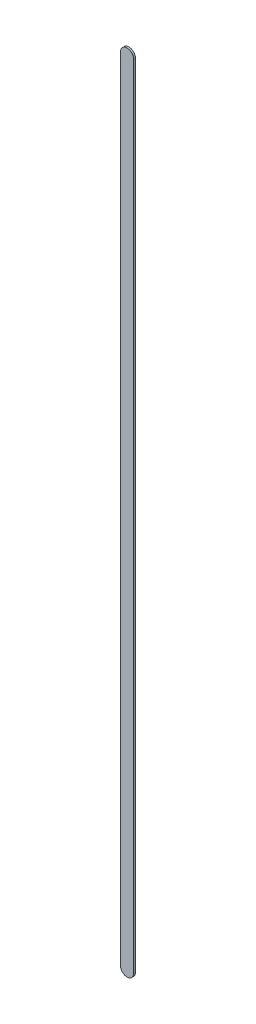
ISO-10303-21;
HEADER;
FILE_DESCRIPTION(('STEP AP214'),'2;1');
FILE_NAME('part.step','',(''),(''),'','','');
FILE_SCHEMA(('AUTOMOTIVE_DESIGN { 1 0 10303 214 1 1 1 1 }'));
ENDSEC;
DATA;
#1=APPLICATION_CONTEXT('core data for automotive mechanical design processes');
#2=APPLICATION_PROTOCOL_DEFINITION('international standard','automotive_design',2000,#1);
#3=PRODUCT_CONTEXT('',#1,'mechanical');
#4=PRODUCT('Part','Part','',(#3));
#5=PRODUCT_RELATED_PRODUCT_CATEGORY('part','',(#4));
#6=PRODUCT_DEFINITION_FORMATION('','',#4);
#7=PRODUCT_DEFINITION_CONTEXT('part definition',#1,'design');
#8=PRODUCT_DEFINITION('design','',#6,#7);
#9=PRODUCT_DEFINITION_SHAPE('','',#8);
#10=(LENGTH_UNIT() NAMED_UNIT(*) SI_UNIT(.MILLI.,.METRE.));
#11=(NAMED_UNIT(*) PLANE_ANGLE_UNIT() SI_UNIT($,.RADIAN.));
#12=(NAMED_UNIT(*) SI_UNIT($,.STERADIAN.) SOLID_ANGLE_UNIT());
#13=UNCERTAINTY_MEASURE_WITH_UNIT(LENGTH_MEASURE(1.E-05),#10,'distance_accuracy_value','');
#14=(GEOMETRIC_REPRESENTATION_CONTEXT(3) GLOBAL_UNCERTAINTY_ASSIGNED_CONTEXT((#13)) GLOBAL_UNIT_ASSIGNED_CONTEXT((#10,
#11,#12)) REPRESENTATION_CONTEXT('',''));
#15=CARTESIAN_POINT('',(0.,0.,0.));
#16=DIRECTION('',(0.,0.,1.));
#17=DIRECTION('',(1.,0.,0.));
#18=AXIS2_PLACEMENT_3D('',#15,#16,#17);
#19=CARTESIAN_POINT('',(78.64397276,81.9869709,0.));
#20=DIRECTION('',(-1.,0.,0.));
#21=DIRECTION('',(0.,1.,0.));
#22=AXIS2_PLACEMENT_3D('',#19,#20,#21);
#23=PLANE('',#22);
#24=DIRECTION('',(0.,1.,0.));
#25=VECTOR('',#24,1.);
#26=CARTESIAN_POINT('',(78.64397276,81.9869709,0.03556));
#27=LINE('',#26,#25);
#28=CARTESIAN_POINT('',(78.64397276,81.9869709,0.03556));
#29=VERTEX_POINT('',#28);
#30=CARTESIAN_POINT('',(78.64397276,97.28697332,0.03556));
#31=VERTEX_POINT('',#30);
#32=EDGE_CURVE('E11',#29,#31,#27,.T.);
#33=ORIENTED_EDGE('',*,*,#32,.F.);
#34=DIRECTION('',(0.,0.,1.));
#35=VECTOR('',#34,1.);
#36=CARTESIAN_POINT('',(78.64397276,81.9869709,0.));
#37=LINE('',#36,#35);
#38=CARTESIAN_POINT('',(78.64397276,81.9869709,0.));
#39=VERTEX_POINT('',#38);
#40=EDGE_CURVE('E24',#39,#29,#37,.T.);
#41=ORIENTED_EDGE('',*,*,#40,.F.);
#42=DIRECTION('',(0.,1.,0.));
#43=VECTOR('',#42,1.);
#44=CARTESIAN_POINT('',(78.64397276,81.9869709,0.));
#45=LINE('',#44,#43);
#46=CARTESIAN_POINT('',(78.64397276,97.28697332,0.));
#47=VERTEX_POINT('',#46);
#48=EDGE_CURVE('E75',#39,#47,#45,.T.);
#49=ORIENTED_EDGE('',*,*,#48,.T.);
#50=DIRECTION('',(0.,0.,1.));
#51=VECTOR('',#50,1.);
#52=CARTESIAN_POINT('',(78.64397276,97.28697332,0.));
#53=LINE('',#52,#51);
#54=EDGE_CURVE('E37',#47,#31,#53,.T.);
#55=ORIENTED_EDGE('',*,*,#54,.T.);
#56=EDGE_LOOP('',(#33,#41,#49,#55));
#57=FACE_BOUND('',#56,.T.);
#58=ADVANCED_FACE('F17',(#57),#23,.F.);
#59=CARTESIAN_POINT('',(78.51697276,97.28697332,0.));
#60=DIRECTION('',(0.,0.,-1.));
#61=DIRECTION('',(1.,1.1189649382048E-13,0.));
#62=AXIS2_PLACEMENT_3D('',#59,#60,#61);
#63=CYLINDRICAL_SURFACE('',#62,0.127000000000005);
#64=CARTESIAN_POINT('',(78.51697276,97.28697332,0.03556));
#65=DIRECTION('',(0.,0.,1.));
#66=DIRECTION('',(1.,1.1189649382048E-13,0.));
#67=AXIS2_PLACEMENT_3D('',#64,#65,#66);
#68=CIRCLE('',#67,0.127000000000005);
#69=CARTESIAN_POINT('',(78.38997276,97.28697332,0.03556));
#70=VERTEX_POINT('',#69);
#71=EDGE_CURVE('E83',#31,#70,#68,.T.);
#72=ORIENTED_EDGE('',*,*,#71,.F.);
#73=ORIENTED_EDGE('',*,*,#54,.F.);
#74=CARTESIAN_POINT('',(78.51697276,97.28697332,0.));
#75=DIRECTION('',(0.,0.,1.));
#76=DIRECTION('',(1.,1.1189649382048E-13,0.));
#77=AXIS2_PLACEMENT_3D('',#74,#75,#76);
#78=CIRCLE('',#77,0.127000000000005);
#79=CARTESIAN_POINT('',(78.38997276,97.28697332,0.));
#80=VERTEX_POINT('',#79);
#81=EDGE_CURVE('E81',#47,#80,#78,.T.);
#82=ORIENTED_EDGE('',*,*,#81,.T.);
#83=DIRECTION('',(0.,0.,1.));
#84=VECTOR('',#83,1.);
#85=CARTESIAN_POINT('',(78.38997276,97.28697332,0.));
#86=LINE('',#85,#84);
#87=EDGE_CURVE('E67',#80,#70,#86,.T.);
#88=ORIENTED_EDGE('',*,*,#87,.T.);
#89=EDGE_LOOP('',(#72,#73,#82,#88));
#90=FACE_BOUND('',#89,.T.);
#91=ADVANCED_FACE('F89',(#90),#63,.T.);
#92=CARTESIAN_POINT('',(78.38997276,97.28697332,0.));
#93=DIRECTION('',(1.,0.,0.));
#94=DIRECTION('',(0.,-1.,0.));
#95=AXIS2_PLACEMENT_3D('',#92,#93,#94);
#96=PLANE('',#95);
#97=DIRECTION('',(0.,-1.,0.));
#98=VECTOR('',#97,1.);
#99=CARTESIAN_POINT('',(78.38997276,97.28697332,0.03556));
#100=LINE('',#99,#98);
#101=CARTESIAN_POINT('',(78.38997276,81.9869709,0.03556));
#102=VERTEX_POINT('',#101);
#103=EDGE_CURVE('E71',#70,#102,#100,.T.);
#104=ORIENTED_EDGE('',*,*,#103,.F.);
#105=ORIENTED_EDGE('',*,*,#87,.F.);
#106=DIRECTION('',(0.,-1.,0.));
#107=VECTOR('',#106,1.);
#108=CARTESIAN_POINT('',(78.38997276,97.28697332,0.));
#109=LINE('',#108,#107);
#110=CARTESIAN_POINT('',(78.38997276,81.9869709,0.));
#111=VERTEX_POINT('',#110);
#112=EDGE_CURVE('E63',#80,#111,#109,.T.);
#113=ORIENTED_EDGE('',*,*,#112,.T.);
#114=DIRECTION('',(0.,0.,1.));
#115=VECTOR('',#114,1.);
#116=CARTESIAN_POINT('',(78.38997276,81.9869709,0.));
#117=LINE('',#116,#115);
#118=EDGE_CURVE('E53',#111,#102,#117,.T.);
#119=ORIENTED_EDGE('',*,*,#118,.T.);
#120=EDGE_LOOP('',(#104,#105,#113,#119));
#121=FACE_BOUND('',#120,.T.);
#122=ADVANCED_FACE('F66',(#121),#96,.F.);
#123=CARTESIAN_POINT('',(78.51697276,81.9869709,0.));
#124=DIRECTION('',(0.,0.,-1.));
#125=DIRECTION('',(-1.,0.,0.));
#126=AXIS2_PLACEMENT_3D('',#123,#124,#125);
#127=CYLINDRICAL_SURFACE('',#126,0.127);
#128=CARTESIAN_POINT('',(78.51697276,81.9869709,0.03556));
#129=DIRECTION('',(0.,0.,1.));
#130=DIRECTION('',(-1.,0.,0.));
#131=AXIS2_PLACEMENT_3D('',#128,#129,#130);
#132=CIRCLE('',#131,0.127);
#133=EDGE_CURVE('E59',#102,#29,#132,.T.);
#134=ORIENTED_EDGE('',*,*,#133,.F.);
#135=ORIENTED_EDGE('',*,*,#118,.F.);
#136=CARTESIAN_POINT('',(78.51697276,81.9869709,0.));
#137=DIRECTION('',(0.,0.,1.));
#138=DIRECTION('',(-1.,0.,0.));
#139=AXIS2_PLACEMENT_3D('',#136,#137,#138);
#140=CIRCLE('',#139,0.127);
#141=EDGE_CURVE('E57',#111,#39,#140,.T.);
#142=ORIENTED_EDGE('',*,*,#141,.T.);
#143=ORIENTED_EDGE('',*,*,#40,.T.);
#144=EDGE_LOOP('',(#134,#135,#142,#143));
#145=FACE_BOUND('',#144,.T.);
#146=ADVANCED_FACE('F55',(#145),#127,.T.);
#147=CARTESIAN_POINT('',(78.64397276,81.9869709,0.));
#148=DIRECTION('',(0.,0.,-1.));
#149=DIRECTION('',(-1.,0.,0.));
#150=AXIS2_PLACEMENT_3D('',#147,#148,#149);
#151=PLANE('',#150);
#152=ORIENTED_EDGE('',*,*,#141,.F.);
#153=ORIENTED_EDGE('',*,*,#112,.F.);
#154=ORIENTED_EDGE('',*,*,#81,.F.);
#155=ORIENTED_EDGE('',*,*,#48,.F.);
#156=EDGE_LOOP('',(#152,#153,#154,#155));
#157=FACE_BOUND('',#156,.T.);
#158=ADVANCED_FACE('F74',(#157),#151,.T.);
#159=CARTESIAN_POINT('',(78.64397276,81.9869709,0.03556));
#160=DIRECTION('',(0.,0.,-1.));
#161=DIRECTION('',(-1.,0.,0.));
#162=AXIS2_PLACEMENT_3D('',#159,#160,#161);
#163=PLANE('',#162);
#164=ORIENTED_EDGE('',*,*,#32,.T.);
#165=ORIENTED_EDGE('',*,*,#71,.T.);
#166=ORIENTED_EDGE('',*,*,#103,.T.);
#167=ORIENTED_EDGE('',*,*,#133,.T.);
#168=EDGE_LOOP('',(#164,#165,#166,#167));
#169=FACE_BOUND('',#168,.T.);
#170=ADVANCED_FACE('F91',(#169),#163,.F.);
#171=CLOSED_SHELL('',(#58,#91,#122,#146,#158,#170));
#172=MANIFOLD_SOLID_BREP('B1',#171);
#173=ADVANCED_BREP_SHAPE_REPRESENTATION('',(#18,#172),#14);
#174=SHAPE_DEFINITION_REPRESENTATION(#9,#173);
ENDSEC;
END-ISO-10303-21;
